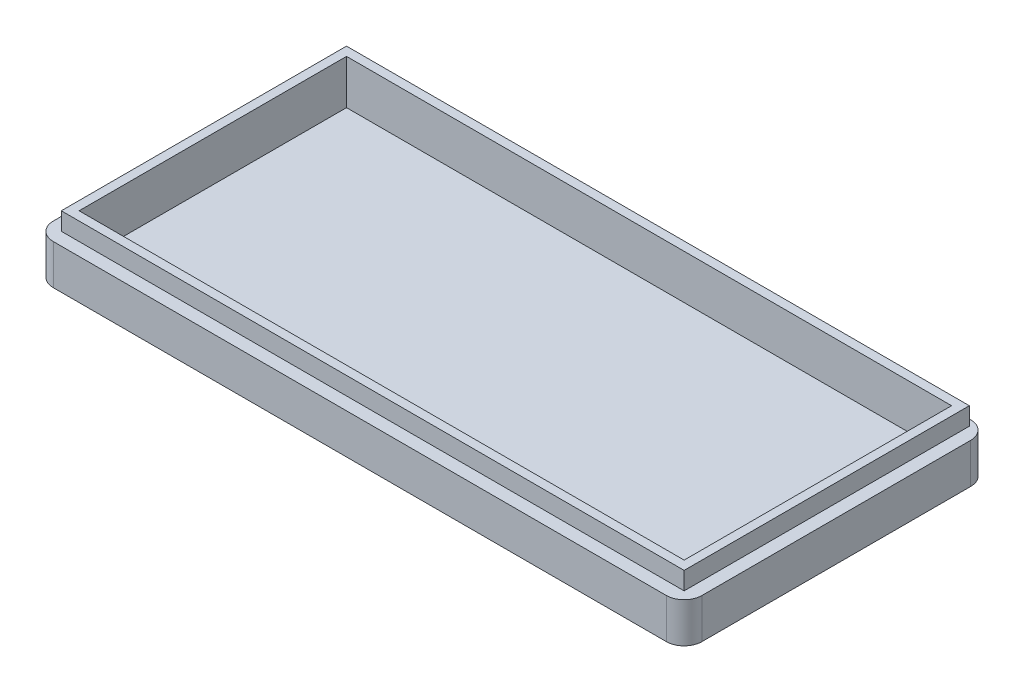
ISO-10303-21;
HEADER;
FILE_DESCRIPTION(('STEP AP214'),'2;1');
FILE_NAME('part.step','',(''),(''),'','','');
FILE_SCHEMA(('AUTOMOTIVE_DESIGN { 1 0 10303 214 1 1 1 1 }'));
ENDSEC;
DATA;
#1=APPLICATION_CONTEXT('core data for automotive mechanical design processes');
#2=APPLICATION_PROTOCOL_DEFINITION('international standard','automotive_design',2000,#1);
#3=PRODUCT_CONTEXT('',#1,'mechanical');
#4=PRODUCT('Part','Part','',(#3));
#5=PRODUCT_RELATED_PRODUCT_CATEGORY('part','',(#4));
#6=PRODUCT_DEFINITION_FORMATION('','',#4);
#7=PRODUCT_DEFINITION_CONTEXT('part definition',#1,'design');
#8=PRODUCT_DEFINITION('design','',#6,#7);
#9=PRODUCT_DEFINITION_SHAPE('','',#8);
#10=(LENGTH_UNIT() NAMED_UNIT(*) SI_UNIT(.MILLI.,.METRE.));
#11=(NAMED_UNIT(*) PLANE_ANGLE_UNIT() SI_UNIT($,.RADIAN.));
#12=(NAMED_UNIT(*) SI_UNIT($,.STERADIAN.) SOLID_ANGLE_UNIT());
#13=UNCERTAINTY_MEASURE_WITH_UNIT(LENGTH_MEASURE(1.E-05),#10,'distance_accuracy_value','');
#14=(GEOMETRIC_REPRESENTATION_CONTEXT(3) GLOBAL_UNCERTAINTY_ASSIGNED_CONTEXT((#13)) GLOBAL_UNIT_ASSIGNED_CONTEXT((#10,
#11,#12)) REPRESENTATION_CONTEXT('',''));
#15=CARTESIAN_POINT('',(0.,0.,0.));
#16=DIRECTION('',(0.,0.,1.));
#17=DIRECTION('',(1.,0.,0.));
#18=AXIS2_PLACEMENT_3D('',#15,#16,#17);
#19=CARTESIAN_POINT('',(0.,4.5,0.));
#20=DIRECTION('',(0.,-1.,0.));
#21=DIRECTION('',(0.,0.,-1.));
#22=AXIS2_PLACEMENT_3D('',#19,#20,#21);
#23=PLANE('',#22);
#24=DIRECTION('',(0.,0.,-1.));
#25=VECTOR('',#24,1.);
#26=CARTESIAN_POINT('',(36.0852272727273,4.5,18.3882575757576));
#27=LINE('',#26,#25);
#28=CARTESIAN_POINT('',(36.0852272727273,4.5,16.3882575757576));
#29=VERTEX_POINT('',#28);
#30=CARTESIAN_POINT('',(36.0852272727272,4.5,-13.8617424242424));
#31=VERTEX_POINT('',#30);
#32=EDGE_CURVE('E253',#29,#31,#27,.T.);
#33=ORIENTED_EDGE('',*,*,#32,.T.);
#34=CARTESIAN_POINT('',(34.0852272727273,4.5,-13.8617424242424));
#35=DIRECTION('',(0.,-1.,0.));
#36=DIRECTION('',(0.,0.,-1.));
#37=AXIS2_PLACEMENT_3D('',#34,#35,#36);
#38=CIRCLE('',#37,2.);
#39=CARTESIAN_POINT('',(34.0852272727273,4.5,-15.8617424242424));
#40=VERTEX_POINT('',#39);
#41=EDGE_CURVE('E310',#31,#40,#38,.F.);
#42=ORIENTED_EDGE('',*,*,#41,.T.);
#43=DIRECTION('',(-1.,0.,0.));
#44=VECTOR('',#43,1.);
#45=CARTESIAN_POINT('',(-36.9147727272727,4.5,-15.8617424242424));
#46=LINE('',#45,#44);
#47=CARTESIAN_POINT('',(-34.9147727272727,4.5,-15.8617424242424));
#48=VERTEX_POINT('',#47);
#49=EDGE_CURVE('E257',#40,#48,#46,.T.);
#50=ORIENTED_EDGE('',*,*,#49,.T.);
#51=CARTESIAN_POINT('',(-34.9147727272727,4.5,-13.8617424242424));
#52=DIRECTION('',(0.,-1.,0.));
#53=DIRECTION('',(0.,0.,-1.));
#54=AXIS2_PLACEMENT_3D('',#51,#52,#53);
#55=CIRCLE('',#54,2.);
#56=CARTESIAN_POINT('',(-36.9147727272727,4.5,-13.8617424242424));
#57=VERTEX_POINT('',#56);
#58=EDGE_CURVE('E301',#48,#57,#55,.F.);
#59=ORIENTED_EDGE('',*,*,#58,.T.);
#60=DIRECTION('',(0.,0.,1.));
#61=VECTOR('',#60,1.);
#62=CARTESIAN_POINT('',(-36.9147727272727,4.5,18.3882575757576));
#63=LINE('',#62,#61);
#64=CARTESIAN_POINT('',(-36.9147727272727,4.5,16.3882575757576));
#65=VERTEX_POINT('',#64);
#66=EDGE_CURVE('E244',#57,#65,#63,.T.);
#67=ORIENTED_EDGE('',*,*,#66,.T.);
#68=CARTESIAN_POINT('',(-34.9147727272727,4.5,16.3882575757576));
#69=DIRECTION('',(0.,-1.,0.));
#70=DIRECTION('',(0.,0.,-1.));
#71=AXIS2_PLACEMENT_3D('',#68,#69,#70);
#72=CIRCLE('',#71,2.);
#73=CARTESIAN_POINT('',(-34.9147727272727,4.5,18.3882575757576));
#74=VERTEX_POINT('',#73);
#75=EDGE_CURVE('E304',#65,#74,#72,.F.);
#76=ORIENTED_EDGE('',*,*,#75,.T.);
#77=DIRECTION('',(1.,0.,0.));
#78=VECTOR('',#77,1.);
#79=CARTESIAN_POINT('',(-36.9147727272727,4.5,18.3882575757576));
#80=LINE('',#79,#78);
#81=CARTESIAN_POINT('',(34.0852272727273,4.5,18.3882575757576));
#82=VERTEX_POINT('',#81);
#83=EDGE_CURVE('E248',#74,#82,#80,.T.);
#84=ORIENTED_EDGE('',*,*,#83,.T.);
#85=CARTESIAN_POINT('',(34.0852272727273,4.5,16.3882575757576));
#86=DIRECTION('',(0.,-1.,0.));
#87=DIRECTION('',(0.,0.,-1.));
#88=AXIS2_PLACEMENT_3D('',#85,#86,#87);
#89=CIRCLE('',#88,2.);
#90=EDGE_CURVE('E307',#82,#29,#89,.F.);
#91=ORIENTED_EDGE('',*,*,#90,.T.);
#92=EDGE_LOOP('',(#33,#42,#50,#59,#67,#76,#84,#91));
#93=FACE_BOUND('',#92,.T.);
#94=DIRECTION('',(0.,0.,1.));
#95=VECTOR('',#94,1.);
#96=CARTESIAN_POINT('',(-35.4647727272727,4.5,16.9382575757576));
#97=LINE('',#96,#95);
#98=CARTESIAN_POINT('',(-35.4647727272727,4.5,-15.1617424242424));
#99=VERTEX_POINT('',#98);
#100=CARTESIAN_POINT('',(-35.4647727272727,4.5,16.9382575757576));
#101=VERTEX_POINT('',#100);
#102=EDGE_CURVE('E203',#99,#101,#97,.T.);
#103=ORIENTED_EDGE('',*,*,#102,.F.);
#104=DIRECTION('',(-1.,0.,0.));
#105=VECTOR('',#104,1.);
#106=CARTESIAN_POINT('',(-35.4647727272727,4.5,-15.1617424242424));
#107=LINE('',#106,#105);
#108=CARTESIAN_POINT('',(34.6352272727272,4.5,-15.1617424242424));
#109=VERTEX_POINT('',#108);
#110=EDGE_CURVE('E209',#109,#99,#107,.T.);
#111=ORIENTED_EDGE('',*,*,#110,.F.);
#112=DIRECTION('',(0.,0.,-1.));
#113=VECTOR('',#112,1.);
#114=CARTESIAN_POINT('',(34.6352272727272,4.5,16.9382575757576));
#115=LINE('',#114,#113);
#116=CARTESIAN_POINT('',(34.6352272727272,4.5,16.9382575757576));
#117=VERTEX_POINT('',#116);
#118=EDGE_CURVE('E60',#117,#109,#115,.T.);
#119=ORIENTED_EDGE('',*,*,#118,.F.);
#120=DIRECTION('',(1.,0.,0.));
#121=VECTOR('',#120,1.);
#122=CARTESIAN_POINT('',(-35.4647727272727,4.5,16.9382575757576));
#123=LINE('',#122,#121);
#124=EDGE_CURVE('E55',#101,#117,#123,.T.);
#125=ORIENTED_EDGE('',*,*,#124,.F.);
#126=EDGE_LOOP('',(#103,#111,#119,#125));
#127=FACE_BOUND('',#126,.T.);
#128=ADVANCED_FACE('F39',(#93,#127),#23,.F.);
#129=CARTESIAN_POINT('',(-36.9147727272727,4.5,18.3882575757576));
#130=DIRECTION('',(1.,0.,0.));
#131=DIRECTION('',(0.,0.,-1.));
#132=AXIS2_PLACEMENT_3D('',#129,#130,#131);
#133=PLANE('',#132);
#134=DIRECTION('',(0.,0.,1.));
#135=VECTOR('',#134,1.);
#136=CARTESIAN_POINT('',(-36.9147727272727,0.,18.3882575757576));
#137=LINE('',#136,#135);
#138=CARTESIAN_POINT('',(-36.9147727272727,0.,-13.8617424242424));
#139=VERTEX_POINT('',#138);
#140=CARTESIAN_POINT('',(-36.9147727272727,0.,16.3882575757576));
#141=VERTEX_POINT('',#140);
#142=EDGE_CURVE('E243',#139,#141,#137,.T.);
#143=ORIENTED_EDGE('',*,*,#142,.T.);
#144=DIRECTION('',(0.,-1.,0.));
#145=VECTOR('',#144,1.);
#146=CARTESIAN_POINT('',(-36.9147727272727,4.5,16.3882575757576));
#147=LINE('',#146,#145);
#148=EDGE_CURVE('E11',#141,#65,#147,.F.);
#149=ORIENTED_EDGE('',*,*,#148,.T.);
#150=ORIENTED_EDGE('',*,*,#66,.F.);
#151=DIRECTION('',(0.,-1.,0.));
#152=VECTOR('',#151,1.);
#153=CARTESIAN_POINT('',(-36.9147727272727,4.5,-13.8617424242424));
#154=LINE('',#153,#152);
#155=EDGE_CURVE('E48',#57,#139,#154,.T.);
#156=ORIENTED_EDGE('',*,*,#155,.T.);
#157=EDGE_LOOP('',(#143,#149,#150,#156));
#158=FACE_BOUND('',#157,.T.);
#159=ADVANCED_FACE('F325',(#158),#133,.F.);
#160=CARTESIAN_POINT('',(-36.9147727272727,4.5,18.3882575757576));
#161=DIRECTION('',(0.,0.,-1.));
#162=DIRECTION('',(-1.,0.,0.));
#163=AXIS2_PLACEMENT_3D('',#160,#161,#162);
#164=PLANE('',#163);
#165=DIRECTION('',(1.,0.,0.));
#166=VECTOR('',#165,1.);
#167=CARTESIAN_POINT('',(-36.9147727272727,0.,18.3882575757576));
#168=LINE('',#167,#166);
#169=CARTESIAN_POINT('',(-34.9147727272727,0.,18.3882575757576));
#170=VERTEX_POINT('',#169);
#171=CARTESIAN_POINT('',(34.0852272727273,0.,18.3882575757576));
#172=VERTEX_POINT('',#171);
#173=EDGE_CURVE('E265',#170,#172,#168,.T.);
#174=ORIENTED_EDGE('',*,*,#173,.T.);
#175=DIRECTION('',(0.,-1.,0.));
#176=VECTOR('',#175,1.);
#177=CARTESIAN_POINT('',(34.0852272727273,4.5,18.3882575757576));
#178=LINE('',#177,#176);
#179=EDGE_CURVE('E317',#172,#82,#178,.F.);
#180=ORIENTED_EDGE('',*,*,#179,.T.);
#181=ORIENTED_EDGE('',*,*,#83,.F.);
#182=DIRECTION('',(0.,-1.,0.));
#183=VECTOR('',#182,1.);
#184=CARTESIAN_POINT('',(-34.9147727272727,4.5,18.3882575757576));
#185=LINE('',#184,#183);
#186=EDGE_CURVE('E313',#74,#170,#185,.T.);
#187=ORIENTED_EDGE('',*,*,#186,.T.);
#188=EDGE_LOOP('',(#174,#180,#181,#187));
#189=FACE_BOUND('',#188,.T.);
#190=ADVANCED_FACE('F339',(#189),#164,.F.);
#191=CARTESIAN_POINT('',(36.0852272727273,4.5,18.3882575757576));
#192=DIRECTION('',(-1.,0.,0.));
#193=DIRECTION('',(0.,0.,1.));
#194=AXIS2_PLACEMENT_3D('',#191,#192,#193);
#195=PLANE('',#194);
#196=DIRECTION('',(0.,0.,-1.));
#197=VECTOR('',#196,1.);
#198=CARTESIAN_POINT('',(36.0852272727273,0.,18.3882575757576));
#199=LINE('',#198,#197);
#200=CARTESIAN_POINT('',(36.0852272727273,0.,16.3882575757576));
#201=VERTEX_POINT('',#200);
#202=CARTESIAN_POINT('',(36.0852272727272,0.,-13.8617424242424));
#203=VERTEX_POINT('',#202);
#204=EDGE_CURVE('E269',#201,#203,#199,.T.);
#205=ORIENTED_EDGE('',*,*,#204,.T.);
#206=DIRECTION('',(0.,-1.,0.));
#207=VECTOR('',#206,1.);
#208=CARTESIAN_POINT('',(36.0852272727272,4.5,-13.8617424242424));
#209=LINE('',#208,#207);
#210=EDGE_CURVE('E298',#203,#31,#209,.F.);
#211=ORIENTED_EDGE('',*,*,#210,.T.);
#212=ORIENTED_EDGE('',*,*,#32,.F.);
#213=DIRECTION('',(0.,-1.,0.));
#214=VECTOR('',#213,1.);
#215=CARTESIAN_POINT('',(36.0852272727273,4.5,16.3882575757576));
#216=LINE('',#215,#214);
#217=EDGE_CURVE('E294',#29,#201,#216,.T.);
#218=ORIENTED_EDGE('',*,*,#217,.T.);
#219=EDGE_LOOP('',(#205,#211,#212,#218));
#220=FACE_BOUND('',#219,.T.);
#221=ADVANCED_FACE('F349',(#220),#195,.F.);
#222=CARTESIAN_POINT('',(-36.9147727272727,4.5,-15.8617424242424));
#223=DIRECTION('',(0.,0.,1.));
#224=DIRECTION('',(1.,0.,0.));
#225=AXIS2_PLACEMENT_3D('',#222,#223,#224);
#226=PLANE('',#225);
#227=ORIENTED_EDGE('',*,*,#49,.F.);
#228=DIRECTION('',(0.,-1.,0.));
#229=VECTOR('',#228,1.);
#230=CARTESIAN_POINT('',(34.0852272727273,4.5,-15.8617424242424));
#231=LINE('',#230,#229);
#232=CARTESIAN_POINT('',(34.0852272727273,0.,-15.8617424242424));
#233=VERTEX_POINT('',#232);
#234=EDGE_CURVE('E278',#40,#233,#231,.T.);
#235=ORIENTED_EDGE('',*,*,#234,.T.);
#236=DIRECTION('',(-1.,0.,0.));
#237=VECTOR('',#236,1.);
#238=CARTESIAN_POINT('',(-36.9147727272727,0.,-15.8617424242424));
#239=LINE('',#238,#237);
#240=CARTESIAN_POINT('',(-34.9147727272727,0.,-15.8617424242424));
#241=VERTEX_POINT('',#240);
#242=EDGE_CURVE('E249',#233,#241,#239,.T.);
#243=ORIENTED_EDGE('',*,*,#242,.T.);
#244=DIRECTION('',(0.,-1.,0.));
#245=VECTOR('',#244,1.);
#246=CARTESIAN_POINT('',(-34.9147727272727,4.5,-15.8617424242424));
#247=LINE('',#246,#245);
#248=EDGE_CURVE('E261',#241,#48,#247,.F.);
#249=ORIENTED_EDGE('',*,*,#248,.T.);
#250=EDGE_LOOP('',(#227,#235,#243,#249));
#251=FACE_BOUND('',#250,.T.);
#252=ADVANCED_FACE('F357',(#251),#226,.F.);
#253=CARTESIAN_POINT('',(0.,0.,0.));
#254=DIRECTION('',(0.,-1.,0.));
#255=DIRECTION('',(0.,0.,-1.));
#256=AXIS2_PLACEMENT_3D('',#253,#254,#255);
#257=PLANE('',#256);
#258=ORIENTED_EDGE('',*,*,#242,.F.);
#259=CARTESIAN_POINT('',(34.0852272727273,0.,-13.8617424242424));
#260=DIRECTION('',(0.,-1.,0.));
#261=DIRECTION('',(0.,0.,-1.));
#262=AXIS2_PLACEMENT_3D('',#259,#260,#261);
#263=CIRCLE('',#262,2.);
#264=EDGE_CURVE('E291',#233,#203,#263,.T.);
#265=ORIENTED_EDGE('',*,*,#264,.T.);
#266=ORIENTED_EDGE('',*,*,#204,.F.);
#267=CARTESIAN_POINT('',(34.0852272727273,0.,16.3882575757576));
#268=DIRECTION('',(0.,-1.,0.));
#269=DIRECTION('',(0.,0.,-1.));
#270=AXIS2_PLACEMENT_3D('',#267,#268,#269);
#271=CIRCLE('',#270,2.);
#272=EDGE_CURVE('E288',#201,#172,#271,.T.);
#273=ORIENTED_EDGE('',*,*,#272,.T.);
#274=ORIENTED_EDGE('',*,*,#173,.F.);
#275=CARTESIAN_POINT('',(-34.9147727272727,0.,16.3882575757576));
#276=DIRECTION('',(0.,-1.,0.));
#277=DIRECTION('',(0.,0.,-1.));
#278=AXIS2_PLACEMENT_3D('',#275,#276,#277);
#279=CIRCLE('',#278,2.);
#280=EDGE_CURVE('E285',#170,#141,#279,.T.);
#281=ORIENTED_EDGE('',*,*,#280,.T.);
#282=ORIENTED_EDGE('',*,*,#142,.F.);
#283=CARTESIAN_POINT('',(-34.9147727272727,0.,-13.8617424242424));
#284=DIRECTION('',(0.,-1.,0.));
#285=DIRECTION('',(0.,0.,-1.));
#286=AXIS2_PLACEMENT_3D('',#283,#284,#285);
#287=CIRCLE('',#286,2.);
#288=EDGE_CURVE('E282',#139,#241,#287,.T.);
#289=ORIENTED_EDGE('',*,*,#288,.T.);
#290=EDGE_LOOP('',(#258,#265,#266,#273,#274,#281,#282,#289));
#291=FACE_BOUND('',#290,.T.);
#292=ADVANCED_FACE('F331',(#291),#257,.T.);
#293=CARTESIAN_POINT('',(34.0852272727273,4.5,-13.8617424242424));
#294=DIRECTION('',(0.,-1.,0.));
#295=DIRECTION('',(0.,0.,-1.));
#296=AXIS2_PLACEMENT_3D('',#293,#294,#295);
#297=CYLINDRICAL_SURFACE('',#296,2.);
#298=ORIENTED_EDGE('',*,*,#41,.F.);
#299=ORIENTED_EDGE('',*,*,#210,.F.);
#300=ORIENTED_EDGE('',*,*,#264,.F.);
#301=ORIENTED_EDGE('',*,*,#234,.F.);
#302=EDGE_LOOP('',(#298,#299,#300,#301));
#303=FACE_BOUND('',#302,.T.);
#304=ADVANCED_FACE('F354',(#303),#297,.T.);
#305=CARTESIAN_POINT('',(34.0852272727273,4.5,16.3882575757576));
#306=DIRECTION('',(0.,-1.,0.));
#307=DIRECTION('',(0.,0.,-1.));
#308=AXIS2_PLACEMENT_3D('',#305,#306,#307);
#309=CYLINDRICAL_SURFACE('',#308,2.);
#310=ORIENTED_EDGE('',*,*,#90,.F.);
#311=ORIENTED_EDGE('',*,*,#179,.F.);
#312=ORIENTED_EDGE('',*,*,#272,.F.);
#313=ORIENTED_EDGE('',*,*,#217,.F.);
#314=EDGE_LOOP('',(#310,#311,#312,#313));
#315=FACE_BOUND('',#314,.T.);
#316=ADVANCED_FACE('F346',(#315),#309,.T.);
#317=CARTESIAN_POINT('',(-34.9147727272727,4.5,16.3882575757576));
#318=DIRECTION('',(0.,-1.,0.));
#319=DIRECTION('',(0.,0.,-1.));
#320=AXIS2_PLACEMENT_3D('',#317,#318,#319);
#321=CYLINDRICAL_SURFACE('',#320,2.);
#322=ORIENTED_EDGE('',*,*,#75,.F.);
#323=ORIENTED_EDGE('',*,*,#148,.F.);
#324=ORIENTED_EDGE('',*,*,#280,.F.);
#325=ORIENTED_EDGE('',*,*,#186,.F.);
#326=EDGE_LOOP('',(#322,#323,#324,#325));
#327=FACE_BOUND('',#326,.T.);
#328=ADVANCED_FACE('F336',(#327),#321,.T.);
#329=CARTESIAN_POINT('',(-34.9147727272727,4.5,-13.8617424242424));
#330=DIRECTION('',(0.,-1.,0.));
#331=DIRECTION('',(0.,0.,-1.));
#332=AXIS2_PLACEMENT_3D('',#329,#330,#331);
#333=CYLINDRICAL_SURFACE('',#332,2.);
#334=ORIENTED_EDGE('',*,*,#58,.F.);
#335=ORIENTED_EDGE('',*,*,#248,.F.);
#336=ORIENTED_EDGE('',*,*,#288,.F.);
#337=ORIENTED_EDGE('',*,*,#155,.F.);
#338=EDGE_LOOP('',(#334,#335,#336,#337));
#339=FACE_BOUND('',#338,.T.);
#340=ADVANCED_FACE('F41',(#339),#333,.T.);
#341=CARTESIAN_POINT('',(0.,6.5,0.));
#342=DIRECTION('',(0.,-1.,0.));
#343=DIRECTION('',(0.,0.,-1.));
#344=AXIS2_PLACEMENT_3D('',#341,#342,#343);
#345=PLANE('',#344);
#346=DIRECTION('',(0.,0.,1.));
#347=VECTOR('',#346,1.);
#348=CARTESIAN_POINT('',(-35.4647727272727,6.5,16.9382575757576));
#349=LINE('',#348,#347);
#350=CARTESIAN_POINT('',(-35.4647727272727,6.5,-15.1617424242424));
#351=VERTEX_POINT('',#350);
#352=CARTESIAN_POINT('',(-35.4647727272727,6.5,16.9382575757576));
#353=VERTEX_POINT('',#352);
#354=EDGE_CURVE('E204',#351,#353,#349,.T.);
#355=ORIENTED_EDGE('',*,*,#354,.T.);
#356=DIRECTION('',(1.,0.,0.));
#357=VECTOR('',#356,1.);
#358=CARTESIAN_POINT('',(-35.4647727272727,6.5,16.9382575757576));
#359=LINE('',#358,#357);
#360=CARTESIAN_POINT('',(34.6352272727272,6.5,16.9382575757576));
#361=VERTEX_POINT('',#360);
#362=EDGE_CURVE('E208',#353,#361,#359,.T.);
#363=ORIENTED_EDGE('',*,*,#362,.T.);
#364=DIRECTION('',(0.,0.,-1.));
#365=VECTOR('',#364,1.);
#366=CARTESIAN_POINT('',(34.6352272727272,6.5,16.9382575757576));
#367=LINE('',#366,#365);
#368=CARTESIAN_POINT('',(34.6352272727272,6.5,-15.1617424242424));
#369=VERTEX_POINT('',#368);
#370=EDGE_CURVE('E212',#361,#369,#367,.T.);
#371=ORIENTED_EDGE('',*,*,#370,.T.);
#372=DIRECTION('',(-1.,0.,0.));
#373=VECTOR('',#372,1.);
#374=CARTESIAN_POINT('',(-35.4647727272727,6.5,-15.1617424242424));
#375=LINE('',#374,#373);
#376=EDGE_CURVE('E215',#369,#351,#375,.T.);
#377=ORIENTED_EDGE('',*,*,#376,.T.);
#378=EDGE_LOOP('',(#355,#363,#371,#377));
#379=FACE_BOUND('',#378,.T.);
#380=DIRECTION('',(0.,0.,1.));
#381=VECTOR('',#380,1.);
#382=CARTESIAN_POINT('',(-34.4647727272727,6.5,15.9382575757576));
#383=LINE('',#382,#381);
#384=CARTESIAN_POINT('',(-34.4647727272727,6.5,-14.1617424242424));
#385=VERTEX_POINT('',#384);
#386=CARTESIAN_POINT('',(-34.4647727272727,6.5,15.9382575757576));
#387=VERTEX_POINT('',#386);
#388=EDGE_CURVE('E184',#385,#387,#383,.T.);
#389=ORIENTED_EDGE('',*,*,#388,.F.);
#390=DIRECTION('',(-1.,0.,0.));
#391=VECTOR('',#390,1.);
#392=CARTESIAN_POINT('',(-34.4647727272727,6.5,-14.1617424242424));
#393=LINE('',#392,#391);
#394=CARTESIAN_POINT('',(33.6352272727272,6.5,-14.1617424242424));
#395=VERTEX_POINT('',#394);
#396=EDGE_CURVE('E157',#395,#385,#393,.T.);
#397=ORIENTED_EDGE('',*,*,#396,.F.);
#398=DIRECTION('',(0.,0.,-1.));
#399=VECTOR('',#398,1.);
#400=CARTESIAN_POINT('',(33.6352272727272,6.5,15.9382575757576));
#401=LINE('',#400,#399);
#402=CARTESIAN_POINT('',(33.6352272727272,6.5,15.9382575757576));
#403=VERTEX_POINT('',#402);
#404=EDGE_CURVE('E190',#403,#395,#401,.T.);
#405=ORIENTED_EDGE('',*,*,#404,.F.);
#406=DIRECTION('',(1.,0.,0.));
#407=VECTOR('',#406,1.);
#408=CARTESIAN_POINT('',(-34.4647727272727,6.5,15.9382575757576));
#409=LINE('',#408,#407);
#410=EDGE_CURVE('E187',#387,#403,#409,.T.);
#411=ORIENTED_EDGE('',*,*,#410,.F.);
#412=EDGE_LOOP('',(#389,#397,#405,#411));
#413=FACE_BOUND('',#412,.T.);
#414=ADVANCED_FACE('F360',(#379,#413),#345,.F.);
#415=CARTESIAN_POINT('',(-35.4647727272727,6.5,16.9382575757576));
#416=DIRECTION('',(1.,0.,0.));
#417=DIRECTION('',(0.,0.,-1.));
#418=AXIS2_PLACEMENT_3D('',#415,#416,#417);
#419=PLANE('',#418);
#420=ORIENTED_EDGE('',*,*,#102,.T.);
#421=DIRECTION('',(0.,-1.,0.));
#422=VECTOR('',#421,1.);
#423=CARTESIAN_POINT('',(-35.4647727272727,6.5,16.9382575757576));
#424=LINE('',#423,#422);
#425=EDGE_CURVE('E240',#353,#101,#424,.T.);
#426=ORIENTED_EDGE('',*,*,#425,.F.);
#427=ORIENTED_EDGE('',*,*,#354,.F.);
#428=DIRECTION('',(0.,-1.,0.));
#429=VECTOR('',#428,1.);
#430=CARTESIAN_POINT('',(-35.4647727272727,6.5,-15.1617424242424));
#431=LINE('',#430,#429);
#432=EDGE_CURVE('E218',#351,#99,#431,.T.);
#433=ORIENTED_EDGE('',*,*,#432,.T.);
#434=EDGE_LOOP('',(#420,#426,#427,#433));
#435=FACE_BOUND('',#434,.T.);
#436=ADVANCED_FACE('F365',(#435),#419,.F.);
#437=CARTESIAN_POINT('',(-35.4647727272727,6.5,16.9382575757576));
#438=DIRECTION('',(0.,0.,-1.));
#439=DIRECTION('',(-1.,0.,0.));
#440=AXIS2_PLACEMENT_3D('',#437,#438,#439);
#441=PLANE('',#440);
#442=ORIENTED_EDGE('',*,*,#124,.T.);
#443=DIRECTION('',(0.,-1.,0.));
#444=VECTOR('',#443,1.);
#445=CARTESIAN_POINT('',(34.6352272727272,6.5,16.9382575757576));
#446=LINE('',#445,#444);
#447=EDGE_CURVE('E236',#361,#117,#446,.T.);
#448=ORIENTED_EDGE('',*,*,#447,.F.);
#449=ORIENTED_EDGE('',*,*,#362,.F.);
#450=ORIENTED_EDGE('',*,*,#425,.T.);
#451=EDGE_LOOP('',(#442,#448,#449,#450));
#452=FACE_BOUND('',#451,.T.);
#453=ADVANCED_FACE('F419',(#452),#441,.F.);
#454=CARTESIAN_POINT('',(34.6352272727272,6.5,16.9382575757576));
#455=DIRECTION('',(-1.,0.,0.));
#456=DIRECTION('',(0.,0.,1.));
#457=AXIS2_PLACEMENT_3D('',#454,#455,#456);
#458=PLANE('',#457);
#459=ORIENTED_EDGE('',*,*,#118,.T.);
#460=DIRECTION('',(0.,-1.,0.));
#461=VECTOR('',#460,1.);
#462=CARTESIAN_POINT('',(34.6352272727272,6.5,-15.1617424242424));
#463=LINE('',#462,#461);
#464=EDGE_CURVE('E232',#369,#109,#463,.T.);
#465=ORIENTED_EDGE('',*,*,#464,.F.);
#466=ORIENTED_EDGE('',*,*,#370,.F.);
#467=ORIENTED_EDGE('',*,*,#447,.T.);
#468=EDGE_LOOP('',(#459,#465,#466,#467));
#469=FACE_BOUND('',#468,.T.);
#470=ADVANCED_FACE('F428',(#469),#458,.F.);
#471=CARTESIAN_POINT('',(-35.4647727272727,6.5,-15.1617424242424));
#472=DIRECTION('',(0.,0.,1.));
#473=DIRECTION('',(1.,0.,0.));
#474=AXIS2_PLACEMENT_3D('',#471,#472,#473);
#475=PLANE('',#474);
#476=ORIENTED_EDGE('',*,*,#110,.T.);
#477=ORIENTED_EDGE('',*,*,#432,.F.);
#478=ORIENTED_EDGE('',*,*,#376,.F.);
#479=ORIENTED_EDGE('',*,*,#464,.T.);
#480=EDGE_LOOP('',(#476,#477,#478,#479));
#481=FACE_BOUND('',#480,.T.);
#482=ADVANCED_FACE('F437',(#481),#475,.F.);
#483=CARTESIAN_POINT('',(-34.4647727272727,6.5,15.9382575757576));
#484=DIRECTION('',(1.,0.,0.));
#485=DIRECTION('',(0.,0.,-1.));
#486=AXIS2_PLACEMENT_3D('',#483,#484,#485);
#487=PLANE('',#486);
#488=DIRECTION('',(0.,-1.,0.));
#489=VECTOR('',#488,1.);
#490=CARTESIAN_POINT('',(-34.4647727272727,6.5,15.9382575757576));
#491=LINE('',#490,#489);
#492=CARTESIAN_POINT('',(-34.4647727272727,1.5,15.9382575757576));
#493=VERTEX_POINT('',#492);
#494=EDGE_CURVE('E167',#387,#493,#491,.T.);
#495=ORIENTED_EDGE('',*,*,#494,.T.);
#496=DIRECTION('',(0.,0.,1.));
#497=VECTOR('',#496,1.);
#498=CARTESIAN_POINT('',(-34.4647727272727,1.5,0.));
#499=LINE('',#498,#497);
#500=CARTESIAN_POINT('',(-34.4647727272727,1.5,-14.1617424242424));
#501=VERTEX_POINT('',#500);
#502=EDGE_CURVE('E164',#501,#493,#499,.T.);
#503=ORIENTED_EDGE('',*,*,#502,.F.);
#504=DIRECTION('',(0.,-1.,0.));
#505=VECTOR('',#504,1.);
#506=CARTESIAN_POINT('',(-34.4647727272727,6.5,-14.1617424242424));
#507=LINE('',#506,#505);
#508=EDGE_CURVE('E150',#385,#501,#507,.T.);
#509=ORIENTED_EDGE('',*,*,#508,.F.);
#510=ORIENTED_EDGE('',*,*,#388,.T.);
#511=EDGE_LOOP('',(#495,#503,#509,#510));
#512=FACE_BOUND('',#511,.T.);
#513=ADVANCED_FACE('F165',(#512),#487,.T.);
#514=CARTESIAN_POINT('',(-34.4647727272727,6.5,15.9382575757576));
#515=DIRECTION('',(0.,0.,-1.));
#516=DIRECTION('',(-1.,0.,0.));
#517=AXIS2_PLACEMENT_3D('',#514,#515,#516);
#518=PLANE('',#517);
#519=DIRECTION('',(0.,-1.,0.));
#520=VECTOR('',#519,1.);
#521=CARTESIAN_POINT('',(33.6352272727272,6.5,15.9382575757576));
#522=LINE('',#521,#520);
#523=CARTESIAN_POINT('',(33.6352272727272,1.5,15.9382575757576));
#524=VERTEX_POINT('',#523);
#525=EDGE_CURVE('E198',#403,#524,#522,.T.);
#526=ORIENTED_EDGE('',*,*,#525,.T.);
#527=DIRECTION('',(1.,0.,0.));
#528=VECTOR('',#527,1.);
#529=CARTESIAN_POINT('',(0.,1.5,15.9382575757576));
#530=LINE('',#529,#528);
#531=EDGE_CURVE('E172',#493,#524,#530,.T.);
#532=ORIENTED_EDGE('',*,*,#531,.F.);
#533=ORIENTED_EDGE('',*,*,#494,.F.);
#534=ORIENTED_EDGE('',*,*,#410,.T.);
#535=EDGE_LOOP('',(#526,#532,#533,#534));
#536=FACE_BOUND('',#535,.T.);
#537=ADVANCED_FACE('F457',(#536),#518,.T.);
#538=CARTESIAN_POINT('',(33.6352272727272,6.5,15.9382575757576));
#539=DIRECTION('',(-1.,0.,0.));
#540=DIRECTION('',(0.,0.,1.));
#541=AXIS2_PLACEMENT_3D('',#538,#539,#540);
#542=PLANE('',#541);
#543=DIRECTION('',(0.,-1.,0.));
#544=VECTOR('',#543,1.);
#545=CARTESIAN_POINT('',(33.6352272727272,6.5,-14.1617424242424));
#546=LINE('',#545,#544);
#547=CARTESIAN_POINT('',(33.6352272727272,1.5,-14.1617424242424));
#548=VERTEX_POINT('',#547);
#549=EDGE_CURVE('E161',#395,#548,#546,.T.);
#550=ORIENTED_EDGE('',*,*,#549,.T.);
#551=DIRECTION('',(0.,0.,-1.));
#552=VECTOR('',#551,1.);
#553=CARTESIAN_POINT('',(33.6352272727272,1.5,0.));
#554=LINE('',#553,#552);
#555=EDGE_CURVE('E176',#524,#548,#554,.T.);
#556=ORIENTED_EDGE('',*,*,#555,.F.);
#557=ORIENTED_EDGE('',*,*,#525,.F.);
#558=ORIENTED_EDGE('',*,*,#404,.T.);
#559=EDGE_LOOP('',(#550,#556,#557,#558));
#560=FACE_BOUND('',#559,.T.);
#561=ADVANCED_FACE('F467',(#560),#542,.T.);
#562=CARTESIAN_POINT('',(-34.4647727272727,6.5,-14.1617424242424));
#563=DIRECTION('',(0.,0.,1.));
#564=DIRECTION('',(1.,0.,0.));
#565=AXIS2_PLACEMENT_3D('',#562,#563,#564);
#566=PLANE('',#565);
#567=ORIENTED_EDGE('',*,*,#508,.T.);
#568=DIRECTION('',(-1.,0.,0.));
#569=VECTOR('',#568,1.);
#570=CARTESIAN_POINT('',(0.,1.5,-14.1617424242424));
#571=LINE('',#570,#569);
#572=EDGE_CURVE('E154',#548,#501,#571,.T.);
#573=ORIENTED_EDGE('',*,*,#572,.F.);
#574=ORIENTED_EDGE('',*,*,#549,.F.);
#575=ORIENTED_EDGE('',*,*,#396,.T.);
#576=EDGE_LOOP('',(#567,#573,#574,#575));
#577=FACE_BOUND('',#576,.T.);
#578=ADVANCED_FACE('F152',(#577),#566,.T.);
#579=CARTESIAN_POINT('',(0.,1.5,0.));
#580=DIRECTION('',(0.,1.,0.));
#581=DIRECTION('',(0.,0.,1.));
#582=AXIS2_PLACEMENT_3D('',#579,#580,#581);
#583=PLANE('',#582);
#584=ORIENTED_EDGE('',*,*,#572,.T.);
#585=ORIENTED_EDGE('',*,*,#502,.T.);
#586=ORIENTED_EDGE('',*,*,#531,.T.);
#587=ORIENTED_EDGE('',*,*,#555,.T.);
#588=EDGE_LOOP('',(#584,#585,#586,#587));
#589=FACE_BOUND('',#588,.T.);
#590=ADVANCED_FACE('F174',(#589),#583,.T.);
#591=CLOSED_SHELL('',(#128,#159,#190,#221,#252,#292,#304,#316,#328,#340,#414,#436,#453,#470,
#482,#513,#537,#561,#578,#590));
#592=MANIFOLD_SOLID_BREP('B2',#591);
#593=ADVANCED_BREP_SHAPE_REPRESENTATION('',(#18,#592),#14);
#594=SHAPE_DEFINITION_REPRESENTATION(#9,#593);
ENDSEC;
END-ISO-10303-21;
